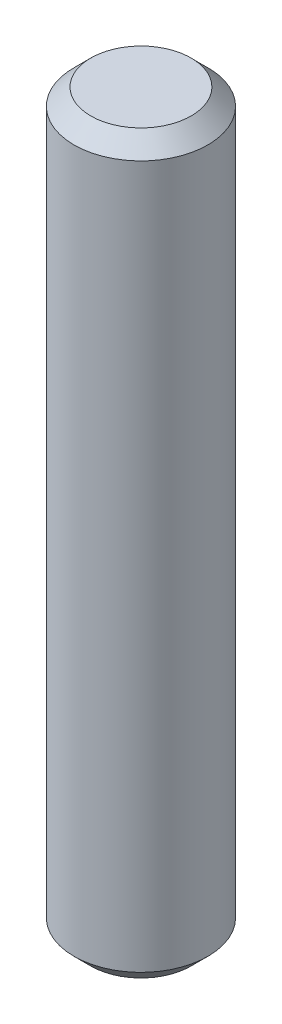
ISO-10303-21;
HEADER;
FILE_DESCRIPTION(('STEP AP214'),'2;1');
FILE_NAME('part.step','',(''),(''),'','','');
FILE_SCHEMA(('AUTOMOTIVE_DESIGN { 1 0 10303 214 1 1 1 1 }'));
ENDSEC;
DATA;
#1=APPLICATION_CONTEXT('core data for automotive mechanical design processes');
#2=APPLICATION_PROTOCOL_DEFINITION('international standard','automotive_design',2000,#1);
#3=PRODUCT_CONTEXT('',#1,'mechanical');
#4=PRODUCT('Part','Part','',(#3));
#5=PRODUCT_RELATED_PRODUCT_CATEGORY('part','',(#4));
#6=PRODUCT_DEFINITION_FORMATION('','',#4);
#7=PRODUCT_DEFINITION_CONTEXT('part definition',#1,'design');
#8=PRODUCT_DEFINITION('design','',#6,#7);
#9=PRODUCT_DEFINITION_SHAPE('','',#8);
#10=(LENGTH_UNIT() NAMED_UNIT(*) SI_UNIT(.MILLI.,.METRE.));
#11=(NAMED_UNIT(*) PLANE_ANGLE_UNIT() SI_UNIT($,.RADIAN.));
#12=(NAMED_UNIT(*) SI_UNIT($,.STERADIAN.) SOLID_ANGLE_UNIT());
#13=UNCERTAINTY_MEASURE_WITH_UNIT(LENGTH_MEASURE(1.E-05),#10,'distance_accuracy_value','');
#14=(GEOMETRIC_REPRESENTATION_CONTEXT(3) GLOBAL_UNCERTAINTY_ASSIGNED_CONTEXT((#13)) GLOBAL_UNIT_ASSIGNED_CONTEXT((#10,
#11,#12)) REPRESENTATION_CONTEXT('',''));
#15=CARTESIAN_POINT('',(0.,0.,0.));
#16=DIRECTION('',(0.,0.,1.));
#17=DIRECTION('',(1.,0.,0.));
#18=AXIS2_PLACEMENT_3D('',#15,#16,#17);
#19=CARTESIAN_POINT('',(0.,22.,0.));
#20=DIRECTION('',(0.,-1.,0.));
#21=DIRECTION('',(0.,0.,-1.));
#22=AXIS2_PLACEMENT_3D('',#19,#20,#21);
#23=CYLINDRICAL_SURFACE('',#22,2.);
#24=CARTESIAN_POINT('',(0.,0.5,0.));
#25=DIRECTION('',(0.,1.,0.));
#26=DIRECTION('',(0.,0.,1.));
#27=AXIS2_PLACEMENT_3D('',#24,#25,#26);
#28=CIRCLE('',#27,2.);
#29=CARTESIAN_POINT('',(0.,0.5,2.));
#30=VERTEX_POINT('',#29);
#31=EDGE_CURVE('E45',#30,#30,#28,.T.);
#32=ORIENTED_EDGE('',*,*,#31,.T.);
#33=EDGE_LOOP('',(#32));
#34=FACE_BOUND('',#33,.T.);
#35=CARTESIAN_POINT('',(0.,21.5,0.));
#36=DIRECTION('',(0.,1.,0.));
#37=DIRECTION('',(0.,0.,1.));
#38=AXIS2_PLACEMENT_3D('',#35,#36,#37);
#39=CIRCLE('',#38,2.);
#40=CARTESIAN_POINT('',(0.,21.5,2.));
#41=VERTEX_POINT('',#40);
#42=EDGE_CURVE('E49',#41,#41,#39,.F.);
#43=ORIENTED_EDGE('',*,*,#42,.T.);
#44=EDGE_LOOP('',(#43));
#45=FACE_BOUND('',#44,.T.);
#46=ADVANCED_FACE('F33',(#34,#45),#23,.T.);
#47=CARTESIAN_POINT('',(0.,22.,0.));
#48=DIRECTION('',(0.,1.,0.));
#49=DIRECTION('',(0.,0.,1.));
#50=AXIS2_PLACEMENT_3D('',#47,#48,#49);
#51=PLANE('',#50);
#52=CARTESIAN_POINT('',(0.,22.,0.));
#53=DIRECTION('',(0.,1.,0.));
#54=DIRECTION('',(0.,0.,1.));
#55=AXIS2_PLACEMENT_3D('',#52,#53,#54);
#56=CIRCLE('',#55,1.5);
#57=CARTESIAN_POINT('',(0.,22.,1.5));
#58=VERTEX_POINT('',#57);
#59=EDGE_CURVE('E10',#58,#58,#56,.T.);
#60=ORIENTED_EDGE('',*,*,#59,.T.);
#61=EDGE_LOOP('',(#60));
#62=FACE_BOUND('',#61,.T.);
#63=ADVANCED_FACE('F65',(#62),#51,.T.);
#64=CARTESIAN_POINT('',(0.,0.,0.));
#65=DIRECTION('',(0.,1.,0.));
#66=DIRECTION('',(0.,0.,1.));
#67=AXIS2_PLACEMENT_3D('',#64,#65,#66);
#68=PLANE('',#67);
#69=CARTESIAN_POINT('',(0.,0.,0.));
#70=DIRECTION('',(0.,1.,0.));
#71=DIRECTION('',(0.,0.,1.));
#72=AXIS2_PLACEMENT_3D('',#69,#70,#71);
#73=CIRCLE('',#72,1.5);
#74=CARTESIAN_POINT('',(0.,0.,1.5));
#75=VERTEX_POINT('',#74);
#76=EDGE_CURVE('E41',#75,#75,#73,.F.);
#77=ORIENTED_EDGE('',*,*,#76,.T.);
#78=EDGE_LOOP('',(#77));
#79=FACE_BOUND('',#78,.T.);
#80=ADVANCED_FACE('F62',(#79),#68,.F.);
#81=CARTESIAN_POINT('',(0.,0.5,0.));
#82=DIRECTION('',(0.,1.,0.));
#83=DIRECTION('',(0.,0.,1.));
#84=AXIS2_PLACEMENT_3D('',#81,#82,#83);
#85=CONICAL_SURFACE('',#84,2.,0.78539816339745);
#86=ORIENTED_EDGE('',*,*,#76,.F.);
#87=EDGE_LOOP('',(#86));
#88=FACE_BOUND('',#87,.T.);
#89=ORIENTED_EDGE('',*,*,#31,.F.);
#90=EDGE_LOOP('',(#89));
#91=FACE_BOUND('',#90,.T.);
#92=ADVANCED_FACE('F58',(#88,#91),#85,.T.);
#93=CARTESIAN_POINT('',(0.,22.,0.));
#94=DIRECTION('',(0.,-1.,0.));
#95=DIRECTION('',(0.,0.,-1.));
#96=AXIS2_PLACEMENT_3D('',#93,#94,#95);
#97=CONICAL_SURFACE('',#96,1.5,0.785398163397447);
#98=ORIENTED_EDGE('',*,*,#42,.F.);
#99=EDGE_LOOP('',(#98));
#100=FACE_BOUND('',#99,.T.);
#101=ORIENTED_EDGE('',*,*,#59,.F.);
#102=EDGE_LOOP('',(#101));
#103=FACE_BOUND('',#102,.T.);
#104=ADVANCED_FACE('F36',(#100,#103),#97,.T.);
#105=CLOSED_SHELL('',(#46,#63,#80,#92,#104));
#106=MANIFOLD_SOLID_BREP('B2',#105);
#107=ADVANCED_BREP_SHAPE_REPRESENTATION('',(#18,#106),#14);
#108=SHAPE_DEFINITION_REPRESENTATION(#9,#107);
ENDSEC;
END-ISO-10303-21;
